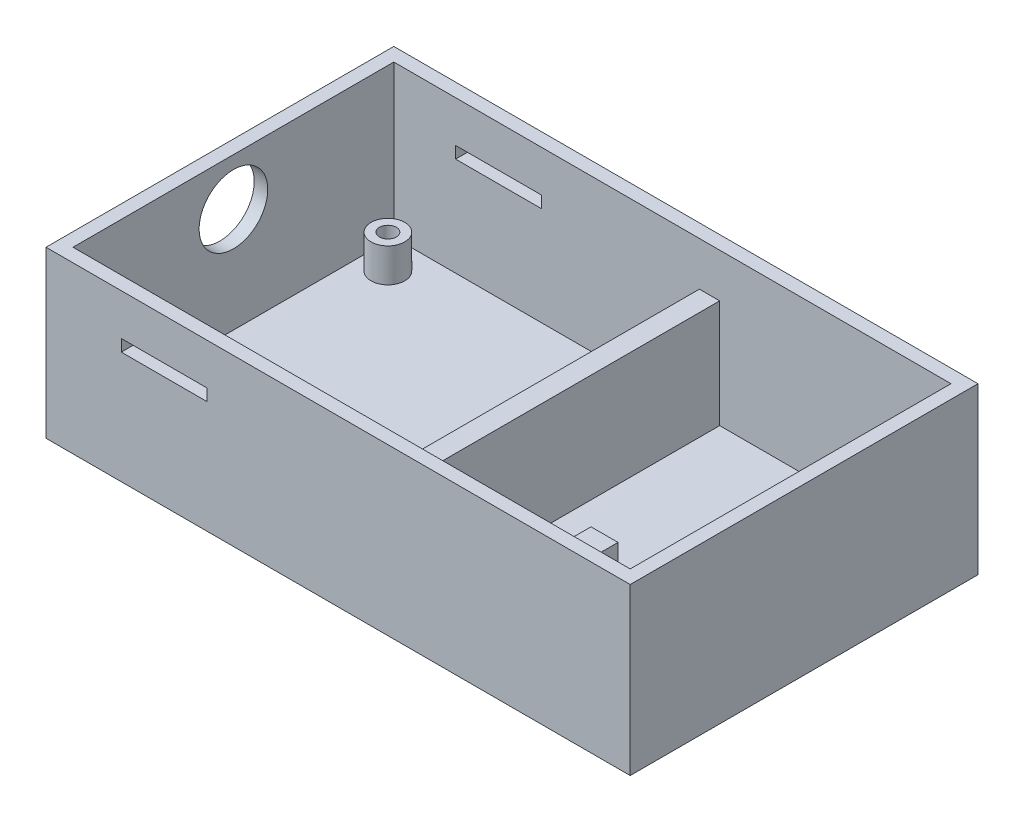
ISO-10303-21;
HEADER;
FILE_DESCRIPTION(('STEP AP214'),'2;1');
FILE_NAME('part.step','',(''),(''),'','','');
FILE_SCHEMA(('AUTOMOTIVE_DESIGN { 1 0 10303 214 1 1 1 1 }'));
ENDSEC;
DATA;
#1=APPLICATION_CONTEXT('core data for automotive mechanical design processes');
#2=APPLICATION_PROTOCOL_DEFINITION('international standard','automotive_design',2000,#1);
#3=PRODUCT_CONTEXT('',#1,'mechanical');
#4=PRODUCT('Part','Part','',(#3));
#5=PRODUCT_RELATED_PRODUCT_CATEGORY('part','',(#4));
#6=PRODUCT_DEFINITION_FORMATION('','',#4);
#7=PRODUCT_DEFINITION_CONTEXT('part definition',#1,'design');
#8=PRODUCT_DEFINITION('design','',#6,#7);
#9=PRODUCT_DEFINITION_SHAPE('','',#8);
#10=(LENGTH_UNIT() NAMED_UNIT(*) SI_UNIT(.MILLI.,.METRE.));
#11=(NAMED_UNIT(*) PLANE_ANGLE_UNIT() SI_UNIT($,.RADIAN.));
#12=(NAMED_UNIT(*) SI_UNIT($,.STERADIAN.) SOLID_ANGLE_UNIT());
#13=UNCERTAINTY_MEASURE_WITH_UNIT(LENGTH_MEASURE(1.E-05),#10,'distance_accuracy_value','');
#14=(GEOMETRIC_REPRESENTATION_CONTEXT(3) GLOBAL_UNCERTAINTY_ASSIGNED_CONTEXT((#13)) GLOBAL_UNIT_ASSIGNED_CONTEXT((#10,
#11,#12)) REPRESENTATION_CONTEXT('',''));
#15=CARTESIAN_POINT('',(0.,0.,0.));
#16=DIRECTION('',(0.,0.,1.));
#17=DIRECTION('',(1.,0.,0.));
#18=AXIS2_PLACEMENT_3D('',#15,#16,#17);
#19=CARTESIAN_POINT('',(0.,45.,47.5));
#20=DIRECTION('',(0.,0.,1.));
#21=DIRECTION('',(1.,0.,0.));
#22=AXIS2_PLACEMENT_3D('',#19,#20,#21);
#23=PLANE('',#22);
#24=DIRECTION('',(-1.,0.,0.));
#25=VECTOR('',#24,1.);
#26=CARTESIAN_POINT('',(0.,32.75,47.5));
#27=LINE('',#26,#25);
#28=CARTESIAN_POINT('',(-38.8,32.75,47.5));
#29=VERTEX_POINT('',#28);
#30=CARTESIAN_POINT('',(-64.2,32.75,47.5));
#31=VERTEX_POINT('',#30);
#32=EDGE_CURVE('E302',#29,#31,#27,.T.);
#33=ORIENTED_EDGE('',*,*,#32,.T.);
#34=DIRECTION('',(0.,-1.,0.));
#35=VECTOR('',#34,1.);
#36=CARTESIAN_POINT('',(-64.2,45.,47.5));
#37=LINE('',#36,#35);
#38=CARTESIAN_POINT('',(-64.2,29.25,47.5));
#39=VERTEX_POINT('',#38);
#40=EDGE_CURVE('E327',#31,#39,#37,.T.);
#41=ORIENTED_EDGE('',*,*,#40,.T.);
#42=DIRECTION('',(1.,0.,0.));
#43=VECTOR('',#42,1.);
#44=CARTESIAN_POINT('',(0.,29.25,47.5));
#45=LINE('',#44,#43);
#46=CARTESIAN_POINT('',(-38.8,29.25,47.5));
#47=VERTEX_POINT('',#46);
#48=EDGE_CURVE('E322',#39,#47,#45,.T.);
#49=ORIENTED_EDGE('',*,*,#48,.T.);
#50=DIRECTION('',(0.,1.,0.));
#51=VECTOR('',#50,1.);
#52=CARTESIAN_POINT('',(-38.8,45.,47.5));
#53=LINE('',#52,#51);
#54=EDGE_CURVE('E317',#47,#29,#53,.T.);
#55=ORIENTED_EDGE('',*,*,#54,.T.);
#56=EDGE_LOOP('',(#33,#41,#49,#55));
#57=FACE_BOUND('',#56,.T.);
#58=DIRECTION('',(0.,-1.,0.));
#59=VECTOR('',#58,1.);
#60=CARTESIAN_POINT('',(53.9012052398662,25.,47.5));
#61=LINE('',#60,#59);
#62=CARTESIAN_POINT('',(53.9012052398662,25.,47.5));
#63=VERTEX_POINT('',#62);
#64=CARTESIAN_POINT('',(53.9012052398662,0.,47.5));
#65=VERTEX_POINT('',#64);
#66=EDGE_CURVE('E523',#63,#65,#61,.T.);
#67=ORIENTED_EDGE('',*,*,#66,.F.);
#68=DIRECTION('',(1.,0.,0.));
#69=VECTOR('',#68,1.);
#70=CARTESIAN_POINT('',(45.9012052398662,25.,47.5));
#71=LINE('',#70,#69);
#72=CARTESIAN_POINT('',(45.9012052398662,25.,47.5));
#73=VERTEX_POINT('',#72);
#74=EDGE_CURVE('E263',#73,#63,#71,.T.);
#75=ORIENTED_EDGE('',*,*,#74,.F.);
#76=DIRECTION('',(0.,-1.,0.));
#77=VECTOR('',#76,1.);
#78=CARTESIAN_POINT('',(45.9012052398662,25.,47.5));
#79=LINE('',#78,#77);
#80=CARTESIAN_POINT('',(45.9012052398662,0.,47.5));
#81=VERTEX_POINT('',#80);
#82=EDGE_CURVE('E275',#73,#81,#79,.T.);
#83=ORIENTED_EDGE('',*,*,#82,.T.);
#84=DIRECTION('',(-1.,0.,0.));
#85=VECTOR('',#84,1.);
#86=CARTESIAN_POINT('',(0.,0.,47.5));
#87=LINE('',#86,#85);
#88=CARTESIAN_POINT('',(14.,0.,47.5));
#89=VERTEX_POINT('',#88);
#90=EDGE_CURVE('E429',#81,#89,#87,.T.);
#91=ORIENTED_EDGE('',*,*,#90,.T.);
#92=DIRECTION('',(0.,-1.,0.));
#93=VECTOR('',#92,1.);
#94=CARTESIAN_POINT('',(14.,32.,47.5));
#95=LINE('',#94,#93);
#96=CARTESIAN_POINT('',(14.,32.,47.5));
#97=VERTEX_POINT('',#96);
#98=EDGE_CURVE('E390',#97,#89,#95,.T.);
#99=ORIENTED_EDGE('',*,*,#98,.F.);
#100=DIRECTION('',(1.,0.,0.));
#101=VECTOR('',#100,1.);
#102=CARTESIAN_POINT('',(7.99999999999999,32.,47.5));
#103=LINE('',#102,#101);
#104=CARTESIAN_POINT('',(7.99999999999999,32.,47.5));
#105=VERTEX_POINT('',#104);
#106=EDGE_CURVE('E376',#105,#97,#103,.T.);
#107=ORIENTED_EDGE('',*,*,#106,.F.);
#108=DIRECTION('',(0.,-1.,0.));
#109=VECTOR('',#108,1.);
#110=CARTESIAN_POINT('',(7.99999999999999,32.,47.5));
#111=LINE('',#110,#109);
#112=CARTESIAN_POINT('',(7.99999999999999,0.,47.5));
#113=VERTEX_POINT('',#112);
#114=EDGE_CURVE('E387',#105,#113,#111,.T.);
#115=ORIENTED_EDGE('',*,*,#114,.T.);
#116=CARTESIAN_POINT('',(-82.5,0.,47.5));
#117=VERTEX_POINT('',#116);
#118=EDGE_CURVE('E425',#113,#117,#87,.T.);
#119=ORIENTED_EDGE('',*,*,#118,.T.);
#120=DIRECTION('',(0.,-1.,0.));
#121=VECTOR('',#120,1.);
#122=CARTESIAN_POINT('',(-82.5,45.,47.5));
#123=LINE('',#122,#121);
#124=CARTESIAN_POINT('',(-82.5,45.,47.5));
#125=VERTEX_POINT('',#124);
#126=EDGE_CURVE('E437',#125,#117,#123,.T.);
#127=ORIENTED_EDGE('',*,*,#126,.F.);
#128=DIRECTION('',(-1.,0.,0.));
#129=VECTOR('',#128,1.);
#130=CARTESIAN_POINT('',(0.,45.,47.5));
#131=LINE('',#130,#129);
#132=CARTESIAN_POINT('',(82.5,45.,47.5));
#133=VERTEX_POINT('',#132);
#134=EDGE_CURVE('E412',#133,#125,#131,.T.);
#135=ORIENTED_EDGE('',*,*,#134,.F.);
#136=DIRECTION('',(0.,-1.,0.));
#137=VECTOR('',#136,1.);
#138=CARTESIAN_POINT('',(82.5,45.,47.5));
#139=LINE('',#138,#137);
#140=CARTESIAN_POINT('',(82.5,0.,47.5));
#141=VERTEX_POINT('',#140);
#142=EDGE_CURVE('E434',#133,#141,#139,.T.);
#143=ORIENTED_EDGE('',*,*,#142,.T.);
#144=EDGE_CURVE('E426',#141,#65,#87,.T.);
#145=ORIENTED_EDGE('',*,*,#144,.T.);
#146=EDGE_LOOP('',(#67,#75,#83,#91,#99,#107,#115,#119,#127,#135,#143,#145));
#147=FACE_BOUND('',#146,.T.);
#148=ADVANCED_FACE('F87',(#57,#147),#23,.F.);
#149=CARTESIAN_POINT('',(0.,0.,0.));
#150=DIRECTION('',(0.,-1.,0.));
#151=DIRECTION('',(0.,0.,-1.));
#152=AXIS2_PLACEMENT_3D('',#149,#150,#151);
#153=PLANE('',#152);
#154=DIRECTION('',(0.,0.,-1.));
#155=VECTOR('',#154,1.);
#156=CARTESIAN_POINT('',(53.9012052398662,0.,47.5));
#157=LINE('',#156,#155);
#158=CARTESIAN_POINT('',(53.9012052398662,0.,22.5));
#159=VERTEX_POINT('',#158);
#160=EDGE_CURVE('E270',#65,#159,#157,.T.);
#161=ORIENTED_EDGE('',*,*,#160,.F.);
#162=ORIENTED_EDGE('',*,*,#144,.F.);
#163=DIRECTION('',(0.,0.,1.));
#164=VECTOR('',#163,1.);
#165=CARTESIAN_POINT('',(82.5,0.,0.));
#166=LINE('',#165,#164);
#167=CARTESIAN_POINT('',(82.5,0.,-47.5));
#168=VERTEX_POINT('',#167);
#169=EDGE_CURVE('E410',#168,#141,#166,.T.);
#170=ORIENTED_EDGE('',*,*,#169,.F.);
#171=DIRECTION('',(-1.,0.,0.));
#172=VECTOR('',#171,1.);
#173=CARTESIAN_POINT('',(0.,0.,-47.5));
#174=LINE('',#173,#172);
#175=CARTESIAN_POINT('',(14.,0.,-47.5));
#176=VERTEX_POINT('',#175);
#177=EDGE_CURVE('E419',#168,#176,#174,.T.);
#178=ORIENTED_EDGE('',*,*,#177,.T.);
#179=DIRECTION('',(0.,0.,1.));
#180=VECTOR('',#179,1.);
#181=CARTESIAN_POINT('',(14.,0.,-47.5));
#182=LINE('',#181,#180);
#183=EDGE_CURVE('E368',#176,#89,#182,.T.);
#184=ORIENTED_EDGE('',*,*,#183,.T.);
#185=ORIENTED_EDGE('',*,*,#90,.F.);
#186=DIRECTION('',(0.,0.,-1.));
#187=VECTOR('',#186,1.);
#188=CARTESIAN_POINT('',(45.9012052398662,0.,47.5));
#189=LINE('',#188,#187);
#190=CARTESIAN_POINT('',(45.9012052398662,0.,22.5));
#191=VERTEX_POINT('',#190);
#192=EDGE_CURVE('E266',#81,#191,#189,.T.);
#193=ORIENTED_EDGE('',*,*,#192,.T.);
#194=DIRECTION('',(-1.,0.,0.));
#195=VECTOR('',#194,1.);
#196=CARTESIAN_POINT('',(53.9012052398662,0.,22.5));
#197=LINE('',#196,#195);
#198=EDGE_CURVE('E103',#159,#191,#197,.T.);
#199=ORIENTED_EDGE('',*,*,#198,.F.);
#200=EDGE_LOOP('',(#161,#162,#170,#178,#184,#185,#193,#199));
#201=FACE_BOUND('',#200,.T.);
#202=ADVANCED_FACE('F479',(#201),#153,.F.);
#203=CARTESIAN_POINT('',(0.,45.,-47.5));
#204=DIRECTION('',(0.,0.,1.));
#205=DIRECTION('',(1.,0.,0.));
#206=AXIS2_PLACEMENT_3D('',#203,#204,#205);
#207=PLANE('',#206);
#208=DIRECTION('',(0.,-1.,0.));
#209=VECTOR('',#208,1.);
#210=CARTESIAN_POINT('',(-64.2,45.,-47.5));
#211=LINE('',#210,#209);
#212=CARTESIAN_POINT('',(-64.2,32.75,-47.5));
#213=VERTEX_POINT('',#212);
#214=CARTESIAN_POINT('',(-64.2,29.25,-47.5));
#215=VERTEX_POINT('',#214);
#216=EDGE_CURVE('E330',#213,#215,#211,.T.);
#217=ORIENTED_EDGE('',*,*,#216,.F.);
#218=DIRECTION('',(-1.,0.,0.));
#219=VECTOR('',#218,1.);
#220=CARTESIAN_POINT('',(0.,32.75,-47.5));
#221=LINE('',#220,#219);
#222=CARTESIAN_POINT('',(-38.8,32.75,-47.5));
#223=VERTEX_POINT('',#222);
#224=EDGE_CURVE('E315',#223,#213,#221,.T.);
#225=ORIENTED_EDGE('',*,*,#224,.F.);
#226=DIRECTION('',(0.,1.,0.));
#227=VECTOR('',#226,1.);
#228=CARTESIAN_POINT('',(-38.8,45.,-47.5));
#229=LINE('',#228,#227);
#230=CARTESIAN_POINT('',(-38.8,29.25,-47.5));
#231=VERTEX_POINT('',#230);
#232=EDGE_CURVE('E320',#231,#223,#229,.T.);
#233=ORIENTED_EDGE('',*,*,#232,.F.);
#234=DIRECTION('',(1.,0.,0.));
#235=VECTOR('',#234,1.);
#236=CARTESIAN_POINT('',(0.,29.25,-47.5));
#237=LINE('',#236,#235);
#238=EDGE_CURVE('E325',#215,#231,#237,.T.);
#239=ORIENTED_EDGE('',*,*,#238,.F.);
#240=EDGE_LOOP('',(#217,#225,#233,#239));
#241=FACE_BOUND('',#240,.T.);
#242=CARTESIAN_POINT('',(7.99999999999998,0.,-47.5));
#243=VERTEX_POINT('',#242);
#244=CARTESIAN_POINT('',(-82.5,0.,-47.5));
#245=VERTEX_POINT('',#244);
#246=EDGE_CURVE('E406',#243,#245,#174,.T.);
#247=ORIENTED_EDGE('',*,*,#246,.F.);
#248=DIRECTION('',(0.,-1.,0.));
#249=VECTOR('',#248,1.);
#250=CARTESIAN_POINT('',(7.99999999999998,32.,-47.5));
#251=LINE('',#250,#249);
#252=CARTESIAN_POINT('',(7.99999999999998,32.,-47.5));
#253=VERTEX_POINT('',#252);
#254=EDGE_CURVE('E384',#253,#243,#251,.T.);
#255=ORIENTED_EDGE('',*,*,#254,.F.);
#256=DIRECTION('',(1.,0.,0.));
#257=VECTOR('',#256,1.);
#258=CARTESIAN_POINT('',(7.99999999999998,32.,-47.5));
#259=LINE('',#258,#257);
#260=CARTESIAN_POINT('',(14.,32.,-47.5));
#261=VERTEX_POINT('',#260);
#262=EDGE_CURVE('E369',#253,#261,#259,.T.);
#263=ORIENTED_EDGE('',*,*,#262,.T.);
#264=DIRECTION('',(0.,-1.,0.));
#265=VECTOR('',#264,1.);
#266=CARTESIAN_POINT('',(14.,32.,-47.5));
#267=LINE('',#266,#265);
#268=EDGE_CURVE('E380',#261,#176,#267,.T.);
#269=ORIENTED_EDGE('',*,*,#268,.T.);
#270=ORIENTED_EDGE('',*,*,#177,.F.);
#271=DIRECTION('',(0.,-1.,0.));
#272=VECTOR('',#271,1.);
#273=CARTESIAN_POINT('',(82.5,45.,-47.5));
#274=LINE('',#273,#272);
#275=CARTESIAN_POINT('',(82.5,45.,-47.5));
#276=VERTEX_POINT('',#275);
#277=EDGE_CURVE('E418',#276,#168,#274,.T.);
#278=ORIENTED_EDGE('',*,*,#277,.F.);
#279=DIRECTION('',(-1.,0.,0.));
#280=VECTOR('',#279,1.);
#281=CARTESIAN_POINT('',(0.,45.,-47.5));
#282=LINE('',#281,#280);
#283=CARTESIAN_POINT('',(-82.5,45.,-47.5));
#284=VERTEX_POINT('',#283);
#285=EDGE_CURVE('E407',#276,#284,#282,.T.);
#286=ORIENTED_EDGE('',*,*,#285,.T.);
#287=DIRECTION('',(0.,-1.,0.));
#288=VECTOR('',#287,1.);
#289=CARTESIAN_POINT('',(-82.5,45.,-47.5));
#290=LINE('',#289,#288);
#291=EDGE_CURVE('E440',#284,#245,#290,.T.);
#292=ORIENTED_EDGE('',*,*,#291,.T.);
#293=EDGE_LOOP('',(#247,#255,#263,#269,#270,#278,#286,#292));
#294=FACE_BOUND('',#293,.T.);
#295=ADVANCED_FACE('F476',(#241,#294),#207,.T.);
#296=CARTESIAN_POINT('',(-74.75,0.,-38.));
#297=DIRECTION('',(0.,-1.,0.));
#298=DIRECTION('',(0.,0.,-1.));
#299=AXIS2_PLACEMENT_3D('',#296,#297,#298);
#300=CIRCLE('',#299,5.00000000000001);
#301=CARTESIAN_POINT('',(-74.75,0.,-43.));
#302=VERTEX_POINT('',#301);
#303=EDGE_CURVE('E12',#302,#302,#300,.F.);
#304=ORIENTED_EDGE('',*,*,#303,.F.);
#305=EDGE_LOOP('',(#304));
#306=FACE_BOUND('',#305,.T.);
#307=CARTESIAN_POINT('',(-74.75,0.,38.));
#308=DIRECTION('',(0.,-1.,0.));
#309=DIRECTION('',(0.,0.,-1.));
#310=AXIS2_PLACEMENT_3D('',#307,#308,#309);
#311=CIRCLE('',#310,5.00000000000001);
#312=CARTESIAN_POINT('',(-74.75,0.,33.));
#313=VERTEX_POINT('',#312);
#314=EDGE_CURVE('E96',#313,#313,#311,.F.);
#315=ORIENTED_EDGE('',*,*,#314,.F.);
#316=EDGE_LOOP('',(#315));
#317=FACE_BOUND('',#316,.T.);
#318=CARTESIAN_POINT('',(0.249999999999972,0.,38.));
#319=DIRECTION('',(0.,-1.,0.));
#320=DIRECTION('',(0.,0.,-1.));
#321=AXIS2_PLACEMENT_3D('',#318,#319,#320);
#322=CIRCLE('',#321,5.);
#323=CARTESIAN_POINT('',(0.249999999999972,0.,33.));
#324=VERTEX_POINT('',#323);
#325=EDGE_CURVE('E464',#324,#324,#322,.F.);
#326=ORIENTED_EDGE('',*,*,#325,.F.);
#327=EDGE_LOOP('',(#326));
#328=FACE_BOUND('',#327,.T.);
#329=CARTESIAN_POINT('',(0.249999999999972,0.,-38.));
#330=DIRECTION('',(0.,-1.,0.));
#331=DIRECTION('',(0.,0.,-1.));
#332=AXIS2_PLACEMENT_3D('',#329,#330,#331);
#333=CIRCLE('',#332,5.);
#334=CARTESIAN_POINT('',(0.249999999999972,0.,-43.));
#335=VERTEX_POINT('',#334);
#336=EDGE_CURVE('E456',#335,#335,#333,.F.);
#337=ORIENTED_EDGE('',*,*,#336,.F.);
#338=EDGE_LOOP('',(#337));
#339=FACE_BOUND('',#338,.T.);
#340=DIRECTION('',(0.,0.,1.));
#341=VECTOR('',#340,1.);
#342=CARTESIAN_POINT('',(7.99999999999998,0.,-47.5));
#343=LINE('',#342,#341);
#344=EDGE_CURVE('E373',#243,#113,#343,.T.);
#345=ORIENTED_EDGE('',*,*,#344,.F.);
#346=ORIENTED_EDGE('',*,*,#246,.T.);
#347=DIRECTION('',(0.,0.,1.));
#348=VECTOR('',#347,1.);
#349=CARTESIAN_POINT('',(-82.5,0.,0.));
#350=LINE('',#349,#348);
#351=EDGE_CURVE('E422',#245,#117,#350,.T.);
#352=ORIENTED_EDGE('',*,*,#351,.T.);
#353=ORIENTED_EDGE('',*,*,#118,.F.);
#354=EDGE_LOOP('',(#345,#346,#352,#353));
#355=FACE_BOUND('',#354,.T.);
#356=ADVANCED_FACE('F472',(#306,#317,#328,#339,#355),#153,.F.);
#357=CARTESIAN_POINT('',(0.,45.,0.));
#358=DIRECTION('',(0.,-1.,0.));
#359=DIRECTION('',(0.,0.,-1.));
#360=AXIS2_PLACEMENT_3D('',#357,#358,#359);
#361=PLANE('',#360);
#362=DIRECTION('',(0.,0.,1.));
#363=VECTOR('',#362,1.);
#364=CARTESIAN_POINT('',(86.5,45.,-51.5));
#365=LINE('',#364,#363);
#366=CARTESIAN_POINT('',(86.5,45.,-51.5));
#367=VERTEX_POINT('',#366);
#368=CARTESIAN_POINT('',(86.5,45.,51.5));
#369=VERTEX_POINT('',#368);
#370=EDGE_CURVE('E443',#367,#369,#365,.T.);
#371=ORIENTED_EDGE('',*,*,#370,.F.);
#372=DIRECTION('',(-1.,0.,0.));
#373=VECTOR('',#372,1.);
#374=CARTESIAN_POINT('',(86.5,45.,-51.5));
#375=LINE('',#374,#373);
#376=CARTESIAN_POINT('',(-86.5,45.,-51.5));
#377=VERTEX_POINT('',#376);
#378=EDGE_CURVE('E451',#367,#377,#375,.T.);
#379=ORIENTED_EDGE('',*,*,#378,.T.);
#380=DIRECTION('',(0.,0.,1.));
#381=VECTOR('',#380,1.);
#382=CARTESIAN_POINT('',(-86.5,45.,-51.5));
#383=LINE('',#382,#381);
#384=CARTESIAN_POINT('',(-86.5,45.,51.5));
#385=VERTEX_POINT('',#384);
#386=EDGE_CURVE('E449',#377,#385,#383,.T.);
#387=ORIENTED_EDGE('',*,*,#386,.T.);
#388=DIRECTION('',(-1.,0.,0.));
#389=VECTOR('',#388,1.);
#390=CARTESIAN_POINT('',(86.5,45.,51.5));
#391=LINE('',#390,#389);
#392=EDGE_CURVE('E446',#369,#385,#391,.T.);
#393=ORIENTED_EDGE('',*,*,#392,.F.);
#394=EDGE_LOOP('',(#371,#379,#387,#393));
#395=FACE_BOUND('',#394,.T.);
#396=ORIENTED_EDGE('',*,*,#285,.F.);
#397=DIRECTION('',(0.,0.,1.));
#398=VECTOR('',#397,1.);
#399=CARTESIAN_POINT('',(82.5,45.,0.));
#400=LINE('',#399,#398);
#401=EDGE_CURVE('E415',#276,#133,#400,.T.);
#402=ORIENTED_EDGE('',*,*,#401,.T.);
#403=ORIENTED_EDGE('',*,*,#134,.T.);
#404=DIRECTION('',(0.,0.,1.));
#405=VECTOR('',#404,1.);
#406=CARTESIAN_POINT('',(-82.5,45.,0.));
#407=LINE('',#406,#405);
#408=EDGE_CURVE('E409',#284,#125,#407,.T.);
#409=ORIENTED_EDGE('',*,*,#408,.F.);
#410=EDGE_LOOP('',(#396,#402,#403,#409));
#411=FACE_BOUND('',#410,.T.);
#412=ADVANCED_FACE('F475',(#395,#411),#361,.F.);
#413=CARTESIAN_POINT('',(86.5,45.,-51.5));
#414=DIRECTION('',(1.,0.,0.));
#415=DIRECTION('',(0.,0.,-1.));
#416=AXIS2_PLACEMENT_3D('',#413,#414,#415);
#417=PLANE('',#416);
#418=DIRECTION('',(0.,-1.,0.));
#419=VECTOR('',#418,1.);
#420=CARTESIAN_POINT('',(86.5,45.,51.5));
#421=LINE('',#420,#419);
#422=CARTESIAN_POINT('',(86.5,-4.,51.5));
#423=VERTEX_POINT('',#422);
#424=EDGE_CURVE('E453',#369,#423,#421,.T.);
#425=ORIENTED_EDGE('',*,*,#424,.T.);
#426=DIRECTION('',(0.,0.,1.));
#427=VECTOR('',#426,1.);
#428=CARTESIAN_POINT('',(86.5,-4.,-51.5));
#429=LINE('',#428,#427);
#430=CARTESIAN_POINT('',(86.5,-4.,-51.5));
#431=VERTEX_POINT('',#430);
#432=EDGE_CURVE('E386',#431,#423,#429,.T.);
#433=ORIENTED_EDGE('',*,*,#432,.F.);
#434=DIRECTION('',(0.,-1.,0.));
#435=VECTOR('',#434,1.);
#436=CARTESIAN_POINT('',(86.5,45.,-51.5));
#437=LINE('',#436,#435);
#438=EDGE_CURVE('E454',#367,#431,#437,.T.);
#439=ORIENTED_EDGE('',*,*,#438,.F.);
#440=ORIENTED_EDGE('',*,*,#370,.T.);
#441=EDGE_LOOP('',(#425,#433,#439,#440));
#442=FACE_BOUND('',#441,.T.);
#443=ADVANCED_FACE('F89',(#442),#417,.T.);
#444=CARTESIAN_POINT('',(86.5,45.,-51.5));
#445=DIRECTION('',(0.,0.,1.));
#446=DIRECTION('',(1.,0.,0.));
#447=AXIS2_PLACEMENT_3D('',#444,#445,#446);
#448=PLANE('',#447);
#449=DIRECTION('',(1.,0.,0.));
#450=VECTOR('',#449,1.);
#451=CARTESIAN_POINT('',(-38.8,32.75,-51.5));
#452=LINE('',#451,#450);
#453=CARTESIAN_POINT('',(-64.2,32.75,-51.5));
#454=VERTEX_POINT('',#453);
#455=CARTESIAN_POINT('',(-38.8,32.75,-51.5));
#456=VERTEX_POINT('',#455);
#457=EDGE_CURVE('E273',#454,#456,#452,.T.);
#458=ORIENTED_EDGE('',*,*,#457,.F.);
#459=DIRECTION('',(0.,1.,0.));
#460=VECTOR('',#459,1.);
#461=CARTESIAN_POINT('',(-64.2,32.75,-51.5));
#462=LINE('',#461,#460);
#463=CARTESIAN_POINT('',(-64.2,29.25,-51.5));
#464=VERTEX_POINT('',#463);
#465=EDGE_CURVE('E271',#464,#454,#462,.T.);
#466=ORIENTED_EDGE('',*,*,#465,.F.);
#467=DIRECTION('',(-1.,0.,0.));
#468=VECTOR('',#467,1.);
#469=CARTESIAN_POINT('',(-38.8,29.25,-51.5));
#470=LINE('',#469,#468);
#471=CARTESIAN_POINT('',(-38.8,29.25,-51.5));
#472=VERTEX_POINT('',#471);
#473=EDGE_CURVE('E283',#472,#464,#470,.T.);
#474=ORIENTED_EDGE('',*,*,#473,.F.);
#475=DIRECTION('',(0.,-1.,0.));
#476=VECTOR('',#475,1.);
#477=CARTESIAN_POINT('',(-38.8,32.75,-51.5));
#478=LINE('',#477,#476);
#479=EDGE_CURVE('E294',#456,#472,#478,.T.);
#480=ORIENTED_EDGE('',*,*,#479,.F.);
#481=EDGE_LOOP('',(#458,#466,#474,#480));
#482=FACE_BOUND('',#481,.T.);
#483=ORIENTED_EDGE('',*,*,#438,.T.);
#484=DIRECTION('',(-1.,0.,0.));
#485=VECTOR('',#484,1.);
#486=CARTESIAN_POINT('',(86.5,-4.,-51.5));
#487=LINE('',#486,#485);
#488=CARTESIAN_POINT('',(-86.5,-4.,-51.5));
#489=VERTEX_POINT('',#488);
#490=EDGE_CURVE('E403',#431,#489,#487,.T.);
#491=ORIENTED_EDGE('',*,*,#490,.T.);
#492=DIRECTION('',(0.,-1.,0.));
#493=VECTOR('',#492,1.);
#494=CARTESIAN_POINT('',(-86.5,45.,-51.5));
#495=LINE('',#494,#493);
#496=EDGE_CURVE('E457',#377,#489,#495,.T.);
#497=ORIENTED_EDGE('',*,*,#496,.F.);
#498=ORIENTED_EDGE('',*,*,#378,.F.);
#499=EDGE_LOOP('',(#483,#491,#497,#498));
#500=FACE_BOUND('',#499,.T.);
#501=ADVANCED_FACE('F541',(#482,#500),#448,.F.);
#502=CARTESIAN_POINT('',(-86.5,45.,-51.5));
#503=DIRECTION('',(1.,0.,0.));
#504=DIRECTION('',(0.,0.,-1.));
#505=AXIS2_PLACEMENT_3D('',#502,#503,#504);
#506=PLANE('',#505);
#507=CARTESIAN_POINT('',(-86.5,31.,0.));
#508=DIRECTION('',(-1.,0.,0.));
#509=DIRECTION('',(0.,0.,1.));
#510=AXIS2_PLACEMENT_3D('',#507,#508,#509);
#511=CIRCLE('',#510,10.16);
#512=CARTESIAN_POINT('',(-86.5,31.,10.16));
#513=VERTEX_POINT('',#512);
#514=EDGE_CURVE('E528',#513,#513,#511,.T.);
#515=ORIENTED_EDGE('',*,*,#514,.F.);
#516=EDGE_LOOP('',(#515));
#517=FACE_BOUND('',#516,.T.);
#518=ORIENTED_EDGE('',*,*,#496,.T.);
#519=DIRECTION('',(0.,0.,1.));
#520=VECTOR('',#519,1.);
#521=CARTESIAN_POINT('',(-86.5,-4.,-51.5));
#522=LINE('',#521,#520);
#523=CARTESIAN_POINT('',(-86.5,-4.,51.5));
#524=VERTEX_POINT('',#523);
#525=EDGE_CURVE('E400',#489,#524,#522,.T.);
#526=ORIENTED_EDGE('',*,*,#525,.T.);
#527=DIRECTION('',(0.,-1.,0.));
#528=VECTOR('',#527,1.);
#529=CARTESIAN_POINT('',(-86.5,45.,51.5));
#530=LINE('',#529,#528);
#531=EDGE_CURVE('E459',#385,#524,#530,.T.);
#532=ORIENTED_EDGE('',*,*,#531,.F.);
#533=ORIENTED_EDGE('',*,*,#386,.F.);
#534=EDGE_LOOP('',(#518,#526,#532,#533));
#535=FACE_BOUND('',#534,.T.);
#536=ADVANCED_FACE('F537',(#517,#535),#506,.F.);
#537=CARTESIAN_POINT('',(86.5,45.,51.5));
#538=DIRECTION('',(0.,0.,1.));
#539=DIRECTION('',(1.,0.,0.));
#540=AXIS2_PLACEMENT_3D('',#537,#538,#539);
#541=PLANE('',#540);
#542=DIRECTION('',(0.,1.,0.));
#543=VECTOR('',#542,1.);
#544=CARTESIAN_POINT('',(-64.2,32.75,51.5));
#545=LINE('',#544,#543);
#546=CARTESIAN_POINT('',(-64.2,29.25,51.5));
#547=VERTEX_POINT('',#546);
#548=CARTESIAN_POINT('',(-64.2,32.75,51.5));
#549=VERTEX_POINT('',#548);
#550=EDGE_CURVE('E279',#547,#549,#545,.T.);
#551=ORIENTED_EDGE('',*,*,#550,.T.);
#552=DIRECTION('',(1.,0.,0.));
#553=VECTOR('',#552,1.);
#554=CARTESIAN_POINT('',(-38.8,32.75,51.5));
#555=LINE('',#554,#553);
#556=CARTESIAN_POINT('',(-38.8,32.75,51.5));
#557=VERTEX_POINT('',#556);
#558=EDGE_CURVE('E282',#549,#557,#555,.T.);
#559=ORIENTED_EDGE('',*,*,#558,.T.);
#560=DIRECTION('',(0.,-1.,0.));
#561=VECTOR('',#560,1.);
#562=CARTESIAN_POINT('',(-38.8,32.75,51.5));
#563=LINE('',#562,#561);
#564=CARTESIAN_POINT('',(-38.8,29.25,51.5));
#565=VERTEX_POINT('',#564);
#566=EDGE_CURVE('E286',#557,#565,#563,.T.);
#567=ORIENTED_EDGE('',*,*,#566,.T.);
#568=DIRECTION('',(-1.,0.,0.));
#569=VECTOR('',#568,1.);
#570=CARTESIAN_POINT('',(-38.8,29.25,51.5));
#571=LINE('',#570,#569);
#572=EDGE_CURVE('E289',#565,#547,#571,.T.);
#573=ORIENTED_EDGE('',*,*,#572,.T.);
#574=EDGE_LOOP('',(#551,#559,#567,#573));
#575=FACE_BOUND('',#574,.T.);
#576=ORIENTED_EDGE('',*,*,#531,.T.);
#577=DIRECTION('',(-1.,0.,0.));
#578=VECTOR('',#577,1.);
#579=CARTESIAN_POINT('',(86.5,-4.,51.5));
#580=LINE('',#579,#578);
#581=EDGE_CURVE('E397',#423,#524,#580,.T.);
#582=ORIENTED_EDGE('',*,*,#581,.F.);
#583=ORIENTED_EDGE('',*,*,#424,.F.);
#584=ORIENTED_EDGE('',*,*,#392,.T.);
#585=EDGE_LOOP('',(#576,#582,#583,#584));
#586=FACE_BOUND('',#585,.T.);
#587=ADVANCED_FACE('F540',(#575,#586),#541,.T.);
#588=CARTESIAN_POINT('',(-82.5,45.,0.));
#589=DIRECTION('',(1.,0.,0.));
#590=DIRECTION('',(0.,0.,-1.));
#591=AXIS2_PLACEMENT_3D('',#588,#589,#590);
#592=PLANE('',#591);
#593=CARTESIAN_POINT('',(-82.5,31.,0.));
#594=DIRECTION('',(1.,0.,0.));
#595=DIRECTION('',(0.,0.,-1.));
#596=AXIS2_PLACEMENT_3D('',#593,#594,#595);
#597=CIRCLE('',#596,10.16);
#598=CARTESIAN_POINT('',(-82.5,31.,-10.16));
#599=VERTEX_POINT('',#598);
#600=EDGE_CURVE('E91',#599,#599,#597,.T.);
#601=ORIENTED_EDGE('',*,*,#600,.F.);
#602=EDGE_LOOP('',(#601));
#603=FACE_BOUND('',#602,.T.);
#604=ORIENTED_EDGE('',*,*,#351,.F.);
#605=ORIENTED_EDGE('',*,*,#291,.F.);
#606=ORIENTED_EDGE('',*,*,#408,.T.);
#607=ORIENTED_EDGE('',*,*,#126,.T.);
#608=EDGE_LOOP('',(#604,#605,#606,#607));
#609=FACE_BOUND('',#608,.T.);
#610=ADVANCED_FACE('F497',(#603,#609),#592,.T.);
#611=CARTESIAN_POINT('',(82.5,45.,0.));
#612=DIRECTION('',(1.,0.,0.));
#613=DIRECTION('',(0.,0.,-1.));
#614=AXIS2_PLACEMENT_3D('',#611,#612,#613);
#615=PLANE('',#614);
#616=ORIENTED_EDGE('',*,*,#169,.T.);
#617=ORIENTED_EDGE('',*,*,#142,.F.);
#618=ORIENTED_EDGE('',*,*,#401,.F.);
#619=ORIENTED_EDGE('',*,*,#277,.T.);
#620=EDGE_LOOP('',(#616,#617,#618,#619));
#621=FACE_BOUND('',#620,.T.);
#622=ADVANCED_FACE('F504',(#621),#615,.F.);
#623=CARTESIAN_POINT('',(0.,-4.,0.));
#624=DIRECTION('',(0.,-1.,0.));
#625=DIRECTION('',(0.,0.,-1.));
#626=AXIS2_PLACEMENT_3D('',#623,#624,#625);
#627=PLANE('',#626);
#628=ORIENTED_EDGE('',*,*,#432,.T.);
#629=ORIENTED_EDGE('',*,*,#581,.T.);
#630=ORIENTED_EDGE('',*,*,#525,.F.);
#631=ORIENTED_EDGE('',*,*,#490,.F.);
#632=EDGE_LOOP('',(#628,#629,#630,#631));
#633=FACE_BOUND('',#632,.T.);
#634=ADVANCED_FACE('F551',(#633),#627,.T.);
#635=CARTESIAN_POINT('',(7.99999999999998,32.,-47.5));
#636=DIRECTION('',(1.,0.,0.));
#637=DIRECTION('',(0.,0.,-1.));
#638=AXIS2_PLACEMENT_3D('',#635,#636,#637);
#639=PLANE('',#638);
#640=ORIENTED_EDGE('',*,*,#344,.T.);
#641=ORIENTED_EDGE('',*,*,#114,.F.);
#642=DIRECTION('',(0.,0.,1.));
#643=VECTOR('',#642,1.);
#644=CARTESIAN_POINT('',(7.99999999999998,32.,-47.5));
#645=LINE('',#644,#643);
#646=EDGE_CURVE('E378',#253,#105,#645,.T.);
#647=ORIENTED_EDGE('',*,*,#646,.F.);
#648=ORIENTED_EDGE('',*,*,#254,.T.);
#649=EDGE_LOOP('',(#640,#641,#647,#648));
#650=FACE_BOUND('',#649,.T.);
#651=ADVANCED_FACE('F685',(#650),#639,.F.);
#652=CARTESIAN_POINT('',(14.,32.,-47.5));
#653=DIRECTION('',(1.,0.,0.));
#654=DIRECTION('',(0.,0.,-1.));
#655=AXIS2_PLACEMENT_3D('',#652,#653,#654);
#656=PLANE('',#655);
#657=ORIENTED_EDGE('',*,*,#183,.F.);
#658=ORIENTED_EDGE('',*,*,#268,.F.);
#659=DIRECTION('',(0.,0.,1.));
#660=VECTOR('',#659,1.);
#661=CARTESIAN_POINT('',(14.,32.,-47.5));
#662=LINE('',#661,#660);
#663=EDGE_CURVE('E372',#261,#97,#662,.T.);
#664=ORIENTED_EDGE('',*,*,#663,.T.);
#665=ORIENTED_EDGE('',*,*,#98,.T.);
#666=EDGE_LOOP('',(#657,#658,#664,#665));
#667=FACE_BOUND('',#666,.T.);
#668=ADVANCED_FACE('F510',(#667),#656,.T.);
#669=CARTESIAN_POINT('',(0.,32.,0.));
#670=DIRECTION('',(0.,-1.,0.));
#671=DIRECTION('',(0.,0.,-1.));
#672=AXIS2_PLACEMENT_3D('',#669,#670,#671);
#673=PLANE('',#672);
#674=ORIENTED_EDGE('',*,*,#262,.F.);
#675=ORIENTED_EDGE('',*,*,#646,.T.);
#676=ORIENTED_EDGE('',*,*,#106,.T.);
#677=ORIENTED_EDGE('',*,*,#663,.F.);
#678=EDGE_LOOP('',(#674,#675,#676,#677));
#679=FACE_BOUND('',#678,.T.);
#680=ADVANCED_FACE('F513',(#679),#673,.F.);
#681=CARTESIAN_POINT('',(0.249999999999972,10.,-38.));
#682=DIRECTION('',(0.,1.,0.));
#683=DIRECTION('',(0.,0.,1.));
#684=AXIS2_PLACEMENT_3D('',#681,#682,#683);
#685=PLANE('',#684);
#686=CARTESIAN_POINT('',(0.249999999999972,10.,-38.));
#687=DIRECTION('',(0.,1.,0.));
#688=DIRECTION('',(0.,0.,1.));
#689=AXIS2_PLACEMENT_3D('',#686,#687,#688);
#690=CIRCLE('',#689,5.);
#691=CARTESIAN_POINT('',(0.249999999999972,10.,-33.));
#692=VERTEX_POINT('',#691);
#693=EDGE_CURVE('E363',#692,#692,#690,.T.);
#694=ORIENTED_EDGE('',*,*,#693,.T.);
#695=EDGE_LOOP('',(#694));
#696=FACE_BOUND('',#695,.T.);
#697=CARTESIAN_POINT('',(0.249999999999972,10.,-38.));
#698=DIRECTION('',(0.,1.,0.));
#699=DIRECTION('',(0.,0.,1.));
#700=AXIS2_PLACEMENT_3D('',#697,#698,#699);
#701=CIRCLE('',#700,2.5);
#702=CARTESIAN_POINT('',(0.249999999999972,10.,-35.5));
#703=VERTEX_POINT('',#702);
#704=EDGE_CURVE('E360',#703,#703,#701,.T.);
#705=ORIENTED_EDGE('',*,*,#704,.F.);
#706=EDGE_LOOP('',(#705));
#707=FACE_BOUND('',#706,.T.);
#708=ADVANCED_FACE('F676',(#696,#707),#685,.T.);
#709=CARTESIAN_POINT('',(0.249999999999972,10.,-38.));
#710=DIRECTION('',(0.,-1.,0.));
#711=DIRECTION('',(0.,0.,-1.));
#712=AXIS2_PLACEMENT_3D('',#709,#710,#711);
#713=CYLINDRICAL_SURFACE('',#712,5.);
#714=ORIENTED_EDGE('',*,*,#693,.F.);
#715=EDGE_LOOP('',(#714));
#716=FACE_BOUND('',#715,.T.);
#717=ORIENTED_EDGE('',*,*,#336,.T.);
#718=EDGE_LOOP('',(#717));
#719=FACE_BOUND('',#718,.T.);
#720=ADVANCED_FACE('F674',(#716,#719),#713,.T.);
#721=CARTESIAN_POINT('',(0.249999999999972,10.,-38.));
#722=DIRECTION('',(0.,-1.,0.));
#723=DIRECTION('',(0.,0.,-1.));
#724=AXIS2_PLACEMENT_3D('',#721,#722,#723);
#725=CYLINDRICAL_SURFACE('',#724,2.5);
#726=ORIENTED_EDGE('',*,*,#704,.T.);
#727=EDGE_LOOP('',(#726));
#728=FACE_BOUND('',#727,.T.);
#729=CARTESIAN_POINT('',(0.249999999999972,0.,-38.));
#730=DIRECTION('',(0.,1.,0.));
#731=DIRECTION('',(0.,0.,1.));
#732=AXIS2_PLACEMENT_3D('',#729,#730,#731);
#733=CIRCLE('',#732,2.5);
#734=CARTESIAN_POINT('',(0.249999999999972,0.,-35.5));
#735=VERTEX_POINT('',#734);
#736=EDGE_CURVE('E357',#735,#735,#733,.T.);
#737=ORIENTED_EDGE('',*,*,#736,.F.);
#738=EDGE_LOOP('',(#737));
#739=FACE_BOUND('',#738,.T.);
#740=ADVANCED_FACE('F671',(#728,#739),#725,.F.);
#741=ORIENTED_EDGE('',*,*,#736,.T.);
#742=EDGE_LOOP('',(#741));
#743=FACE_BOUND('',#742,.T.);
#744=ADVANCED_FACE('F480',(#743),#153,.F.);
#745=CARTESIAN_POINT('',(0.249999999999972,10.,38.));
#746=DIRECTION('',(0.,1.,0.));
#747=DIRECTION('',(0.,0.,1.));
#748=AXIS2_PLACEMENT_3D('',#745,#746,#747);
#749=PLANE('',#748);
#750=CARTESIAN_POINT('',(0.249999999999972,10.,38.));
#751=DIRECTION('',(0.,1.,0.));
#752=DIRECTION('',(0.,0.,1.));
#753=AXIS2_PLACEMENT_3D('',#750,#751,#752);
#754=CIRCLE('',#753,5.);
#755=CARTESIAN_POINT('',(0.249999999999972,10.,43.));
#756=VERTEX_POINT('',#755);
#757=EDGE_CURVE('E348',#756,#756,#754,.T.);
#758=ORIENTED_EDGE('',*,*,#757,.T.);
#759=EDGE_LOOP('',(#758));
#760=FACE_BOUND('',#759,.T.);
#761=CARTESIAN_POINT('',(0.249999999999972,10.,38.));
#762=DIRECTION('',(0.,1.,0.));
#763=DIRECTION('',(0.,0.,1.));
#764=AXIS2_PLACEMENT_3D('',#761,#762,#763);
#765=CIRCLE('',#764,2.5);
#766=CARTESIAN_POINT('',(0.249999999999972,10.,40.5));
#767=VERTEX_POINT('',#766);
#768=EDGE_CURVE('E353',#767,#767,#765,.T.);
#769=ORIENTED_EDGE('',*,*,#768,.F.);
#770=EDGE_LOOP('',(#769));
#771=FACE_BOUND('',#770,.T.);
#772=ADVANCED_FACE('F663',(#760,#771),#749,.T.);
#773=CARTESIAN_POINT('',(0.249999999999972,10.,38.));
#774=DIRECTION('',(0.,-1.,0.));
#775=DIRECTION('',(0.,0.,-1.));
#776=AXIS2_PLACEMENT_3D('',#773,#774,#775);
#777=CYLINDRICAL_SURFACE('',#776,5.);
#778=ORIENTED_EDGE('',*,*,#757,.F.);
#779=EDGE_LOOP('',(#778));
#780=FACE_BOUND('',#779,.T.);
#781=ORIENTED_EDGE('',*,*,#325,.T.);
#782=EDGE_LOOP('',(#781));
#783=FACE_BOUND('',#782,.T.);
#784=ADVANCED_FACE('F659',(#780,#783),#777,.T.);
#785=CARTESIAN_POINT('',(0.249999999999972,10.,38.));
#786=DIRECTION('',(0.,-1.,0.));
#787=DIRECTION('',(0.,0.,-1.));
#788=AXIS2_PLACEMENT_3D('',#785,#786,#787);
#789=CYLINDRICAL_SURFACE('',#788,2.5);
#790=ORIENTED_EDGE('',*,*,#768,.T.);
#791=EDGE_LOOP('',(#790));
#792=FACE_BOUND('',#791,.T.);
#793=CARTESIAN_POINT('',(0.249999999999972,0.,38.));
#794=DIRECTION('',(0.,1.,0.));
#795=DIRECTION('',(0.,0.,1.));
#796=AXIS2_PLACEMENT_3D('',#793,#794,#795);
#797=CIRCLE('',#796,2.5);
#798=CARTESIAN_POINT('',(0.249999999999972,0.,40.5));
#799=VERTEX_POINT('',#798);
#800=EDGE_CURVE('E354',#799,#799,#797,.T.);
#801=ORIENTED_EDGE('',*,*,#800,.F.);
#802=EDGE_LOOP('',(#801));
#803=FACE_BOUND('',#802,.T.);
#804=ADVANCED_FACE('F662',(#792,#803),#789,.F.);
#805=ORIENTED_EDGE('',*,*,#800,.T.);
#806=EDGE_LOOP('',(#805));
#807=FACE_BOUND('',#806,.T.);
#808=ADVANCED_FACE('F654',(#807),#153,.F.);
#809=CARTESIAN_POINT('',(-74.75,10.,38.));
#810=DIRECTION('',(0.,1.,0.));
#811=DIRECTION('',(0.,0.,1.));
#812=AXIS2_PLACEMENT_3D('',#809,#810,#811);
#813=PLANE('',#812);
#814=CARTESIAN_POINT('',(-74.75,10.,38.));
#815=DIRECTION('',(0.,1.,0.));
#816=DIRECTION('',(0.,0.,1.));
#817=AXIS2_PLACEMENT_3D('',#814,#815,#816);
#818=CIRCLE('',#817,5.00000000000001);
#819=CARTESIAN_POINT('',(-74.75,10.,43.));
#820=VERTEX_POINT('',#819);
#821=EDGE_CURVE('E339',#820,#820,#818,.T.);
#822=ORIENTED_EDGE('',*,*,#821,.T.);
#823=EDGE_LOOP('',(#822));
#824=FACE_BOUND('',#823,.T.);
#825=CARTESIAN_POINT('',(-74.75,10.,38.));
#826=DIRECTION('',(0.,1.,0.));
#827=DIRECTION('',(0.,0.,1.));
#828=AXIS2_PLACEMENT_3D('',#825,#826,#827);
#829=CIRCLE('',#828,2.5);
#830=CARTESIAN_POINT('',(-74.75,10.,40.5));
#831=VERTEX_POINT('',#830);
#832=EDGE_CURVE('E344',#831,#831,#829,.T.);
#833=ORIENTED_EDGE('',*,*,#832,.F.);
#834=EDGE_LOOP('',(#833));
#835=FACE_BOUND('',#834,.T.);
#836=ADVANCED_FACE('F650',(#824,#835),#813,.T.);
#837=CARTESIAN_POINT('',(-74.75,10.,38.));
#838=DIRECTION('',(0.,-1.,0.));
#839=DIRECTION('',(0.,0.,-1.));
#840=AXIS2_PLACEMENT_3D('',#837,#838,#839);
#841=CYLINDRICAL_SURFACE('',#840,5.00000000000001);
#842=ORIENTED_EDGE('',*,*,#821,.F.);
#843=EDGE_LOOP('',(#842));
#844=FACE_BOUND('',#843,.T.);
#845=ORIENTED_EDGE('',*,*,#314,.T.);
#846=EDGE_LOOP('',(#845));
#847=FACE_BOUND('',#846,.T.);
#848=ADVANCED_FACE('F470',(#844,#847),#841,.T.);
#849=CARTESIAN_POINT('',(-74.75,10.,38.));
#850=DIRECTION('',(0.,-1.,0.));
#851=DIRECTION('',(0.,0.,-1.));
#852=AXIS2_PLACEMENT_3D('',#849,#850,#851);
#853=CYLINDRICAL_SURFACE('',#852,2.5);
#854=ORIENTED_EDGE('',*,*,#832,.T.);
#855=EDGE_LOOP('',(#854));
#856=FACE_BOUND('',#855,.T.);
#857=CARTESIAN_POINT('',(-74.75,0.,38.));
#858=DIRECTION('',(0.,1.,0.));
#859=DIRECTION('',(0.,0.,1.));
#860=AXIS2_PLACEMENT_3D('',#857,#858,#859);
#861=CIRCLE('',#860,2.5);
#862=CARTESIAN_POINT('',(-74.75,0.,40.5));
#863=VERTEX_POINT('',#862);
#864=EDGE_CURVE('E345',#863,#863,#861,.T.);
#865=ORIENTED_EDGE('',*,*,#864,.F.);
#866=EDGE_LOOP('',(#865));
#867=FACE_BOUND('',#866,.T.);
#868=ADVANCED_FACE('F649',(#856,#867),#853,.F.);
#869=ORIENTED_EDGE('',*,*,#864,.T.);
#870=EDGE_LOOP('',(#869));
#871=FACE_BOUND('',#870,.T.);
#872=ADVANCED_FACE('F642',(#871),#153,.F.);
#873=CARTESIAN_POINT('',(-74.75,10.,-38.));
#874=DIRECTION('',(0.,1.,0.));
#875=DIRECTION('',(0.,0.,1.));
#876=AXIS2_PLACEMENT_3D('',#873,#874,#875);
#877=PLANE('',#876);
#878=CARTESIAN_POINT('',(-74.75,10.,-38.));
#879=DIRECTION('',(0.,1.,0.));
#880=DIRECTION('',(0.,0.,1.));
#881=AXIS2_PLACEMENT_3D('',#878,#879,#880);
#882=CIRCLE('',#881,5.00000000000001);
#883=CARTESIAN_POINT('',(-74.75,10.,-33.));
#884=VERTEX_POINT('',#883);
#885=EDGE_CURVE('E332',#884,#884,#882,.T.);
#886=ORIENTED_EDGE('',*,*,#885,.T.);
#887=EDGE_LOOP('',(#886));
#888=FACE_BOUND('',#887,.T.);
#889=CARTESIAN_POINT('',(-74.75,10.,-38.));
#890=DIRECTION('',(0.,1.,0.));
#891=DIRECTION('',(0.,0.,1.));
#892=AXIS2_PLACEMENT_3D('',#889,#890,#891);
#893=CIRCLE('',#892,2.5);
#894=CARTESIAN_POINT('',(-74.75,10.,-35.5));
#895=VERTEX_POINT('',#894);
#896=EDGE_CURVE('E335',#895,#895,#893,.T.);
#897=ORIENTED_EDGE('',*,*,#896,.F.);
#898=EDGE_LOOP('',(#897));
#899=FACE_BOUND('',#898,.T.);
#900=ADVANCED_FACE('F638',(#888,#899),#877,.T.);
#901=CARTESIAN_POINT('',(-74.75,10.,-38.));
#902=DIRECTION('',(0.,-1.,0.));
#903=DIRECTION('',(0.,0.,-1.));
#904=AXIS2_PLACEMENT_3D('',#901,#902,#903);
#905=CYLINDRICAL_SURFACE('',#904,5.00000000000001);
#906=ORIENTED_EDGE('',*,*,#885,.F.);
#907=EDGE_LOOP('',(#906));
#908=FACE_BOUND('',#907,.T.);
#909=ORIENTED_EDGE('',*,*,#303,.T.);
#910=EDGE_LOOP('',(#909));
#911=FACE_BOUND('',#910,.T.);
#912=ADVANCED_FACE('F634',(#908,#911),#905,.T.);
#913=CARTESIAN_POINT('',(-74.75,10.,-38.));
#914=DIRECTION('',(0.,-1.,0.));
#915=DIRECTION('',(0.,0.,-1.));
#916=AXIS2_PLACEMENT_3D('',#913,#914,#915);
#917=CYLINDRICAL_SURFACE('',#916,2.5);
#918=ORIENTED_EDGE('',*,*,#896,.T.);
#919=EDGE_LOOP('',(#918));
#920=FACE_BOUND('',#919,.T.);
#921=CARTESIAN_POINT('',(-74.75,0.,-38.));
#922=DIRECTION('',(0.,1.,0.));
#923=DIRECTION('',(0.,0.,1.));
#924=AXIS2_PLACEMENT_3D('',#921,#922,#923);
#925=CIRCLE('',#924,2.5);
#926=CARTESIAN_POINT('',(-74.75,0.,-35.5));
#927=VERTEX_POINT('',#926);
#928=EDGE_CURVE('E336',#927,#927,#925,.T.);
#929=ORIENTED_EDGE('',*,*,#928,.F.);
#930=EDGE_LOOP('',(#929));
#931=FACE_BOUND('',#930,.T.);
#932=ADVANCED_FACE('F637',(#920,#931),#917,.F.);
#933=ORIENTED_EDGE('',*,*,#928,.T.);
#934=EDGE_LOOP('',(#933));
#935=FACE_BOUND('',#934,.T.);
#936=ADVANCED_FACE('F572',(#935),#153,.F.);
#937=CARTESIAN_POINT('',(-38.8,32.75,51.5));
#938=DIRECTION('',(0.,1.,0.));
#939=DIRECTION('',(0.,0.,1.));
#940=AXIS2_PLACEMENT_3D('',#937,#938,#939);
#941=PLANE('',#940);
#942=DIRECTION('',(0.,0.,-1.));
#943=VECTOR('',#942,1.);
#944=CARTESIAN_POINT('',(-38.8,32.75,51.5));
#945=LINE('',#944,#943);
#946=EDGE_CURVE('E308',#557,#29,#945,.T.);
#947=ORIENTED_EDGE('',*,*,#946,.F.);
#948=ORIENTED_EDGE('',*,*,#558,.F.);
#949=DIRECTION('',(0.,0.,-1.));
#950=VECTOR('',#949,1.);
#951=CARTESIAN_POINT('',(-64.2,32.75,51.5));
#952=LINE('',#951,#950);
#953=EDGE_CURVE('E311',#549,#31,#952,.T.);
#954=ORIENTED_EDGE('',*,*,#953,.T.);
#955=ORIENTED_EDGE('',*,*,#32,.F.);
#956=EDGE_LOOP('',(#947,#948,#954,#955));
#957=FACE_BOUND('',#956,.T.);
#958=ADVANCED_FACE('F609',(#957),#941,.F.);
#959=CARTESIAN_POINT('',(-38.8,32.75,51.5));
#960=DIRECTION('',(1.,0.,0.));
#961=DIRECTION('',(0.,0.,-1.));
#962=AXIS2_PLACEMENT_3D('',#959,#960,#961);
#963=PLANE('',#962);
#964=DIRECTION('',(0.,0.,-1.));
#965=VECTOR('',#964,1.);
#966=CARTESIAN_POINT('',(-38.8,29.25,51.5));
#967=LINE('',#966,#965);
#968=EDGE_CURVE('E304',#565,#47,#967,.T.);
#969=ORIENTED_EDGE('',*,*,#968,.F.);
#970=ORIENTED_EDGE('',*,*,#566,.F.);
#971=ORIENTED_EDGE('',*,*,#946,.T.);
#972=ORIENTED_EDGE('',*,*,#54,.F.);
#973=EDGE_LOOP('',(#969,#970,#971,#972));
#974=FACE_BOUND('',#973,.T.);
#975=ADVANCED_FACE('F603',(#974),#963,.F.);
#976=CARTESIAN_POINT('',(-38.8,29.25,51.5));
#977=DIRECTION('',(0.,-1.,0.));
#978=DIRECTION('',(0.,0.,-1.));
#979=AXIS2_PLACEMENT_3D('',#976,#977,#978);
#980=PLANE('',#979);
#981=DIRECTION('',(0.,0.,-1.));
#982=VECTOR('',#981,1.);
#983=CARTESIAN_POINT('',(-64.2,29.25,51.5));
#984=LINE('',#983,#982);
#985=EDGE_CURVE('E299',#547,#39,#984,.T.);
#986=ORIENTED_EDGE('',*,*,#985,.F.);
#987=ORIENTED_EDGE('',*,*,#572,.F.);
#988=ORIENTED_EDGE('',*,*,#968,.T.);
#989=ORIENTED_EDGE('',*,*,#48,.F.);
#990=EDGE_LOOP('',(#986,#987,#988,#989));
#991=FACE_BOUND('',#990,.T.);
#992=ADVANCED_FACE('F611',(#991),#980,.F.);
#993=CARTESIAN_POINT('',(-64.2,32.75,51.5));
#994=DIRECTION('',(-1.,0.,0.));
#995=DIRECTION('',(0.,0.,1.));
#996=AXIS2_PLACEMENT_3D('',#993,#994,#995);
#997=PLANE('',#996);
#998=ORIENTED_EDGE('',*,*,#953,.F.);
#999=ORIENTED_EDGE('',*,*,#550,.F.);
#1000=ORIENTED_EDGE('',*,*,#985,.T.);
#1001=ORIENTED_EDGE('',*,*,#40,.F.);
#1002=EDGE_LOOP('',(#998,#999,#1000,#1001));
#1003=FACE_BOUND('',#1002,.T.);
#1004=ADVANCED_FACE('F618',(#1003),#997,.F.);
#1005=ORIENTED_EDGE('',*,*,#216,.T.);
#1006=EDGE_CURVE('E303',#215,#464,#984,.T.);
#1007=ORIENTED_EDGE('',*,*,#1006,.T.);
#1008=ORIENTED_EDGE('',*,*,#465,.T.);
#1009=EDGE_CURVE('E291',#213,#454,#952,.T.);
#1010=ORIENTED_EDGE('',*,*,#1009,.F.);
#1011=EDGE_LOOP('',(#1005,#1007,#1008,#1010));
#1012=FACE_BOUND('',#1011,.T.);
#1013=ADVANCED_FACE('F588',(#1012),#997,.F.);
#1014=ORIENTED_EDGE('',*,*,#238,.T.);
#1015=EDGE_CURVE('E307',#231,#472,#967,.T.);
#1016=ORIENTED_EDGE('',*,*,#1015,.T.);
#1017=ORIENTED_EDGE('',*,*,#473,.T.);
#1018=ORIENTED_EDGE('',*,*,#1006,.F.);
#1019=EDGE_LOOP('',(#1014,#1016,#1017,#1018));
#1020=FACE_BOUND('',#1019,.T.);
#1021=ADVANCED_FACE('F591',(#1020),#980,.F.);
#1022=ORIENTED_EDGE('',*,*,#232,.T.);
#1023=EDGE_CURVE('E111',#223,#456,#945,.T.);
#1024=ORIENTED_EDGE('',*,*,#1023,.T.);
#1025=ORIENTED_EDGE('',*,*,#479,.T.);
#1026=ORIENTED_EDGE('',*,*,#1015,.F.);
#1027=EDGE_LOOP('',(#1022,#1024,#1025,#1026));
#1028=FACE_BOUND('',#1027,.T.);
#1029=ADVANCED_FACE('F600',(#1028),#963,.F.);
#1030=ORIENTED_EDGE('',*,*,#224,.T.);
#1031=ORIENTED_EDGE('',*,*,#1009,.T.);
#1032=ORIENTED_EDGE('',*,*,#457,.T.);
#1033=ORIENTED_EDGE('',*,*,#1023,.F.);
#1034=EDGE_LOOP('',(#1030,#1031,#1032,#1033));
#1035=FACE_BOUND('',#1034,.T.);
#1036=ADVANCED_FACE('F598',(#1035),#941,.F.);
#1037=CARTESIAN_POINT('',(53.9012052398662,25.,47.5));
#1038=DIRECTION('',(-1.,0.,0.));
#1039=DIRECTION('',(0.,0.,1.));
#1040=AXIS2_PLACEMENT_3D('',#1037,#1038,#1039);
#1041=PLANE('',#1040);
#1042=ORIENTED_EDGE('',*,*,#160,.T.);
#1043=DIRECTION('',(0.,-1.,0.));
#1044=VECTOR('',#1043,1.);
#1045=CARTESIAN_POINT('',(53.9012052398662,25.,22.5));
#1046=LINE('',#1045,#1044);
#1047=CARTESIAN_POINT('',(53.9012052398662,25.,22.5));
#1048=VERTEX_POINT('',#1047);
#1049=EDGE_CURVE('E251',#1048,#159,#1046,.T.);
#1050=ORIENTED_EDGE('',*,*,#1049,.F.);
#1051=DIRECTION('',(0.,0.,-1.));
#1052=VECTOR('',#1051,1.);
#1053=CARTESIAN_POINT('',(53.9012052398662,25.,47.5));
#1054=LINE('',#1053,#1052);
#1055=EDGE_CURVE('E258',#63,#1048,#1054,.T.);
#1056=ORIENTED_EDGE('',*,*,#1055,.F.);
#1057=ORIENTED_EDGE('',*,*,#66,.T.);
#1058=EDGE_LOOP('',(#1042,#1050,#1056,#1057));
#1059=FACE_BOUND('',#1058,.T.);
#1060=ADVANCED_FACE('F268',(#1059),#1041,.F.);
#1061=CARTESIAN_POINT('',(53.9012052398662,25.,22.5));
#1062=DIRECTION('',(0.,0.,1.));
#1063=DIRECTION('',(1.,0.,0.));
#1064=AXIS2_PLACEMENT_3D('',#1061,#1062,#1063);
#1065=PLANE('',#1064);
#1066=ORIENTED_EDGE('',*,*,#198,.T.);
#1067=DIRECTION('',(0.,-1.,0.));
#1068=VECTOR('',#1067,1.);
#1069=CARTESIAN_POINT('',(45.9012052398662,25.,22.5));
#1070=LINE('',#1069,#1068);
#1071=CARTESIAN_POINT('',(45.9012052398662,25.,22.5));
#1072=VERTEX_POINT('',#1071);
#1073=EDGE_CURVE('E253',#1072,#191,#1070,.T.);
#1074=ORIENTED_EDGE('',*,*,#1073,.F.);
#1075=DIRECTION('',(-1.,0.,0.));
#1076=VECTOR('',#1075,1.);
#1077=CARTESIAN_POINT('',(53.9012052398662,25.,22.5));
#1078=LINE('',#1077,#1076);
#1079=EDGE_CURVE('E247',#1048,#1072,#1078,.T.);
#1080=ORIENTED_EDGE('',*,*,#1079,.F.);
#1081=ORIENTED_EDGE('',*,*,#1049,.T.);
#1082=EDGE_LOOP('',(#1066,#1074,#1080,#1081));
#1083=FACE_BOUND('',#1082,.T.);
#1084=ADVANCED_FACE('F249',(#1083),#1065,.F.);
#1085=CARTESIAN_POINT('',(45.9012052398662,25.,47.5));
#1086=DIRECTION('',(-1.,0.,0.));
#1087=DIRECTION('',(0.,0.,1.));
#1088=AXIS2_PLACEMENT_3D('',#1085,#1086,#1087);
#1089=PLANE('',#1088);
#1090=ORIENTED_EDGE('',*,*,#192,.F.);
#1091=ORIENTED_EDGE('',*,*,#82,.F.);
#1092=DIRECTION('',(0.,0.,-1.));
#1093=VECTOR('',#1092,1.);
#1094=CARTESIAN_POINT('',(45.9012052398662,25.,47.5));
#1095=LINE('',#1094,#1093);
#1096=EDGE_CURVE('E257',#73,#1072,#1095,.T.);
#1097=ORIENTED_EDGE('',*,*,#1096,.T.);
#1098=ORIENTED_EDGE('',*,*,#1073,.T.);
#1099=EDGE_LOOP('',(#1090,#1091,#1097,#1098));
#1100=FACE_BOUND('',#1099,.T.);
#1101=ADVANCED_FACE('F524',(#1100),#1089,.T.);
#1102=CARTESIAN_POINT('',(0.,25.,0.));
#1103=DIRECTION('',(0.,1.,0.));
#1104=DIRECTION('',(0.,0.,1.));
#1105=AXIS2_PLACEMENT_3D('',#1102,#1103,#1104);
#1106=PLANE('',#1105);
#1107=ORIENTED_EDGE('',*,*,#1055,.T.);
#1108=ORIENTED_EDGE('',*,*,#1079,.T.);
#1109=ORIENTED_EDGE('',*,*,#1096,.F.);
#1110=ORIENTED_EDGE('',*,*,#74,.T.);
#1111=EDGE_LOOP('',(#1107,#1108,#1109,#1110));
#1112=FACE_BOUND('',#1111,.T.);
#1113=ADVANCED_FACE('F261',(#1112),#1106,.T.);
#1114=CARTESIAN_POINT('',(-76.5,31.,0.));
#1115=DIRECTION('',(-1.,0.,0.));
#1116=DIRECTION('',(0.,0.,1.));
#1117=AXIS2_PLACEMENT_3D('',#1114,#1115,#1116);
#1118=CYLINDRICAL_SURFACE('',#1117,10.16);
#1119=ORIENTED_EDGE('',*,*,#600,.T.);
#1120=EDGE_LOOP('',(#1119));
#1121=FACE_BOUND('',#1120,.T.);
#1122=ORIENTED_EDGE('',*,*,#514,.T.);
#1123=EDGE_LOOP('',(#1122));
#1124=FACE_BOUND('',#1123,.T.);
#1125=ADVANCED_FACE('F535',(#1121,#1124),#1118,.F.);
#1126=CLOSED_SHELL('',(#148,#202,#295,#356,#412,#443,#501,#536,#587,#610,#622,#634,#651,#668,
#680,#708,#720,#740,#744,#772,#784,#804,#808,#836,#848,#868,#872,#900,#912,#932,#936,#958,#975,
#992,#1004,#1013,#1021,#1029,#1036,#1060,#1084,#1101,#1113,#1125));
#1127=MANIFOLD_SOLID_BREP('B2',#1126);
#1128=ADVANCED_BREP_SHAPE_REPRESENTATION('',(#18,#1127),#14);
#1129=SHAPE_DEFINITION_REPRESENTATION(#9,#1128);
ENDSEC;
END-ISO-10303-21;
